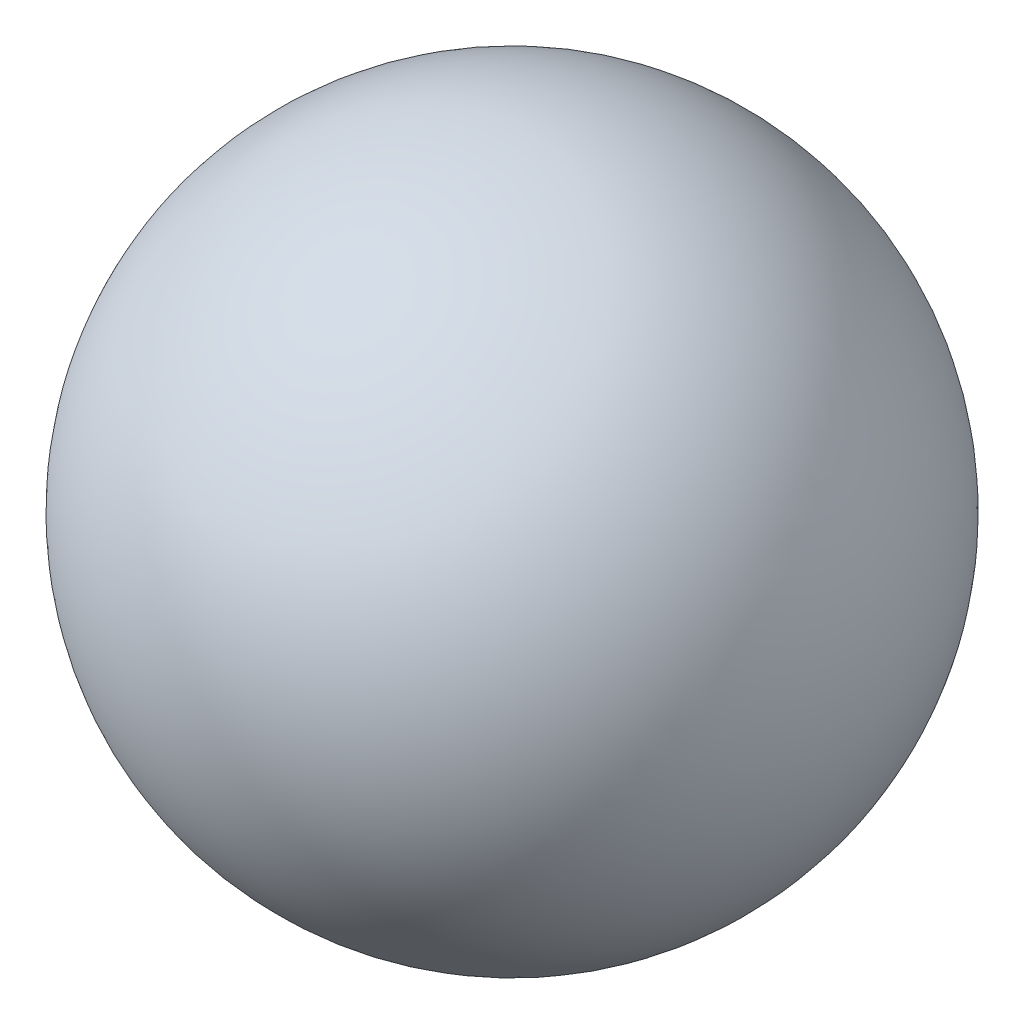
ISO-10303-21;
HEADER;
FILE_DESCRIPTION(('STEP AP214'),'2;1');
FILE_NAME('part.step','',(''),(''),'','','');
FILE_SCHEMA(('AUTOMOTIVE_DESIGN { 1 0 10303 214 1 1 1 1 }'));
ENDSEC;
DATA;
#1=APPLICATION_CONTEXT('core data for automotive mechanical design processes');
#2=APPLICATION_PROTOCOL_DEFINITION('international standard','automotive_design',2000,#1);
#3=PRODUCT_CONTEXT('',#1,'mechanical');
#4=PRODUCT('Part','Part','',(#3));
#5=PRODUCT_RELATED_PRODUCT_CATEGORY('part','',(#4));
#6=PRODUCT_DEFINITION_FORMATION('','',#4);
#7=PRODUCT_DEFINITION_CONTEXT('part definition',#1,'design');
#8=PRODUCT_DEFINITION('design','',#6,#7);
#9=PRODUCT_DEFINITION_SHAPE('','',#8);
#10=(LENGTH_UNIT() NAMED_UNIT(*) SI_UNIT(.MILLI.,.METRE.));
#11=(NAMED_UNIT(*) PLANE_ANGLE_UNIT() SI_UNIT($,.RADIAN.));
#12=(NAMED_UNIT(*) SI_UNIT($,.STERADIAN.) SOLID_ANGLE_UNIT());
#13=UNCERTAINTY_MEASURE_WITH_UNIT(LENGTH_MEASURE(1.E-05),#10,'distance_accuracy_value','');
#14=(GEOMETRIC_REPRESENTATION_CONTEXT(3) GLOBAL_UNCERTAINTY_ASSIGNED_CONTEXT((#13)) GLOBAL_UNIT_ASSIGNED_CONTEXT((#10,
#11,#12)) REPRESENTATION_CONTEXT('',''));
#15=CARTESIAN_POINT('',(0.,0.,0.));
#16=DIRECTION('',(0.,0.,1.));
#17=DIRECTION('',(1.,0.,0.));
#18=AXIS2_PLACEMENT_3D('',#15,#16,#17);
#19=CARTESIAN_POINT('',(0.,0.,0.));
#20=DIRECTION('',(-1.,0.,0.));
#21=DIRECTION('',(0.,0.,-1.));
#22=AXIS2_PLACEMENT_3D('',#19,#20,#21);
#23=SPHERICAL_SURFACE('',#22,12.7);
#24=CARTESIAN_POINT('',(12.7,0.,0.));
#25=VERTEX_POINT('',#24);
#26=VERTEX_LOOP('',#25);
#27=FACE_BOUND('',#26,.T.);
#28=CARTESIAN_POINT('',(-12.7,0.,0.));
#29=VERTEX_POINT('',#28);
#30=VERTEX_LOOP('',#29);
#31=FACE_BOUND('',#30,.T.);
#32=ADVANCED_FACE('F16',(#27,#31),#23,.T.);
#33=CLOSED_SHELL('',(#32));
#34=MANIFOLD_SOLID_BREP('B1',#33);
#35=ADVANCED_BREP_SHAPE_REPRESENTATION('',(#18,#34),#14);
#36=SHAPE_DEFINITION_REPRESENTATION(#9,#35);
ENDSEC;
END-ISO-10303-21;
